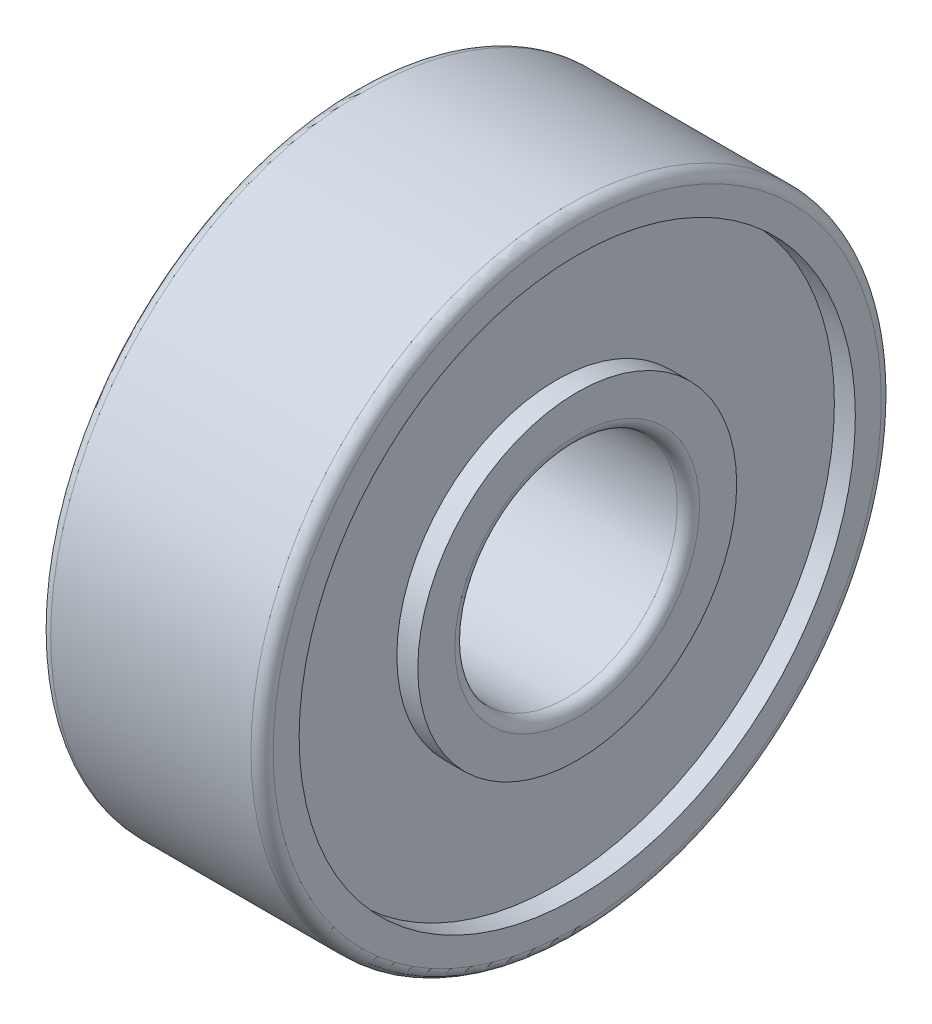
ISO-10303-21;
HEADER;
FILE_DESCRIPTION(('STEP AP214'),'2;1');
FILE_NAME('part.step','',(''),(''),'','','');
FILE_SCHEMA(('AUTOMOTIVE_DESIGN { 1 0 10303 214 1 1 1 1 }'));
ENDSEC;
DATA;
#1=APPLICATION_CONTEXT('core data for automotive mechanical design processes');
#2=APPLICATION_PROTOCOL_DEFINITION('international standard','automotive_design',2000,#1);
#3=PRODUCT_CONTEXT('',#1,'mechanical');
#4=PRODUCT('Part','Part','',(#3));
#5=PRODUCT_RELATED_PRODUCT_CATEGORY('part','',(#4));
#6=PRODUCT_DEFINITION_FORMATION('','',#4);
#7=PRODUCT_DEFINITION_CONTEXT('part definition',#1,'design');
#8=PRODUCT_DEFINITION('design','',#6,#7);
#9=PRODUCT_DEFINITION_SHAPE('','',#8);
#10=(LENGTH_UNIT() NAMED_UNIT(*) SI_UNIT(.MILLI.,.METRE.));
#11=(NAMED_UNIT(*) PLANE_ANGLE_UNIT() SI_UNIT($,.RADIAN.));
#12=(NAMED_UNIT(*) SI_UNIT($,.STERADIAN.) SOLID_ANGLE_UNIT());
#13=UNCERTAINTY_MEASURE_WITH_UNIT(LENGTH_MEASURE(1.E-05),#10,'distance_accuracy_value','');
#14=(GEOMETRIC_REPRESENTATION_CONTEXT(3) GLOBAL_UNCERTAINTY_ASSIGNED_CONTEXT((#13)) GLOBAL_UNIT_ASSIGNED_CONTEXT((#10,
#11,#12)) REPRESENTATION_CONTEXT('',''));
#15=CARTESIAN_POINT('',(0.,0.,0.));
#16=DIRECTION('',(0.,0.,1.));
#17=DIRECTION('',(1.,0.,0.));
#18=AXIS2_PLACEMENT_3D('',#15,#16,#17);
#19=CARTESIAN_POINT('',(7.5,0.,0.));
#20=DIRECTION('',(-1.,0.,0.));
#21=DIRECTION('',(0.,0.,1.));
#22=AXIS2_PLACEMENT_3D('',#19,#20,#21);
#23=CYLINDRICAL_SURFACE('',#22,3.);
#24=CARTESIAN_POINT('',(10.2,0.,0.));
#25=DIRECTION('',(1.,0.,0.));
#26=DIRECTION('',(0.,0.,1.));
#27=AXIS2_PLACEMENT_3D('',#24,#25,#26);
#28=CIRCLE('',#27,3.);
#29=CARTESIAN_POINT('',(10.2,0.,3.));
#30=VERTEX_POINT('',#29);
#31=EDGE_CURVE('E144',#30,#30,#28,.F.);
#32=ORIENTED_EDGE('',*,*,#31,.F.);
#33=EDGE_LOOP('',(#32));
#34=FACE_BOUND('',#33,.T.);
#35=CARTESIAN_POINT('',(4.8,0.,0.));
#36=DIRECTION('',(1.,0.,0.));
#37=DIRECTION('',(0.,0.,1.));
#38=AXIS2_PLACEMENT_3D('',#35,#36,#37);
#39=CIRCLE('',#38,3.);
#40=CARTESIAN_POINT('',(4.8,0.,3.));
#41=VERTEX_POINT('',#40);
#42=EDGE_CURVE('E152',#41,#41,#39,.T.);
#43=ORIENTED_EDGE('',*,*,#42,.F.);
#44=EDGE_LOOP('',(#43));
#45=FACE_BOUND('',#44,.T.);
#46=ADVANCED_FACE('F17',(#34,#45),#23,.F.);
#47=CARTESIAN_POINT('',(4.8,0.,0.));
#48=DIRECTION('',(1.,0.,0.));
#49=DIRECTION('',(0.,0.,1.));
#50=AXIS2_PLACEMENT_3D('',#47,#48,#49);
#51=TOROIDAL_SURFACE('',#50,3.3,0.300000000000001);
#52=ORIENTED_EDGE('',*,*,#42,.T.);
#53=EDGE_LOOP('',(#52));
#54=FACE_BOUND('',#53,.T.);
#55=CARTESIAN_POINT('',(4.5,0.,0.));
#56=DIRECTION('',(-1.,0.,0.));
#57=DIRECTION('',(0.,0.,-1.));
#58=AXIS2_PLACEMENT_3D('',#55,#56,#57);
#59=CIRCLE('',#58,3.3);
#60=CARTESIAN_POINT('',(4.5,-3.3,0.));
#61=VERTEX_POINT('',#60);
#62=CARTESIAN_POINT('',(4.5,0.,-3.3));
#63=VERTEX_POINT('',#62);
#64=EDGE_CURVE('E75',#61,#63,#59,.F.);
#65=ORIENTED_EDGE('',*,*,#64,.F.);
#66=CARTESIAN_POINT('',(4.5,0.,0.));
#67=DIRECTION('',(-1.,0.,0.));
#68=DIRECTION('',(0.,-1.,0.));
#69=AXIS2_PLACEMENT_3D('',#66,#67,#68);
#70=CIRCLE('',#69,3.3);
#71=CARTESIAN_POINT('',(4.5,0.,3.3));
#72=VERTEX_POINT('',#71);
#73=EDGE_CURVE('E72',#72,#61,#70,.F.);
#74=ORIENTED_EDGE('',*,*,#73,.F.);
#75=CARTESIAN_POINT('',(4.5,0.,0.));
#76=DIRECTION('',(-1.,0.,0.));
#77=DIRECTION('',(0.,0.,1.));
#78=AXIS2_PLACEMENT_3D('',#75,#76,#77);
#79=CIRCLE('',#78,3.3);
#80=EDGE_CURVE('E69',#63,#72,#79,.F.);
#81=ORIENTED_EDGE('',*,*,#80,.F.);
#82=EDGE_LOOP('',(#65,#74,#81));
#83=FACE_BOUND('',#82,.T.);
#84=ADVANCED_FACE('F74',(#54,#83),#51,.T.);
#85=CARTESIAN_POINT('',(10.2,0.,0.));
#86=DIRECTION('',(1.,0.,0.));
#87=DIRECTION('',(0.,0.,1.));
#88=AXIS2_PLACEMENT_3D('',#85,#86,#87);
#89=TOROIDAL_SURFACE('',#88,3.3,0.299999999999999);
#90=ORIENTED_EDGE('',*,*,#31,.T.);
#91=EDGE_LOOP('',(#90));
#92=FACE_BOUND('',#91,.T.);
#93=CARTESIAN_POINT('',(10.5,0.,0.));
#94=DIRECTION('',(1.,0.,0.));
#95=DIRECTION('',(0.,0.,-1.));
#96=AXIS2_PLACEMENT_3D('',#93,#94,#95);
#97=CIRCLE('',#96,3.3);
#98=CARTESIAN_POINT('',(10.5,0.,3.3));
#99=VERTEX_POINT('',#98);
#100=CARTESIAN_POINT('',(10.5,0.,-3.3));
#101=VERTEX_POINT('',#100);
#102=EDGE_CURVE('E123',#99,#101,#97,.F.);
#103=ORIENTED_EDGE('',*,*,#102,.F.);
#104=CARTESIAN_POINT('',(10.5,0.,0.));
#105=DIRECTION('',(1.,0.,0.));
#106=DIRECTION('',(0.,0.,1.));
#107=AXIS2_PLACEMENT_3D('',#104,#105,#106);
#108=CIRCLE('',#107,3.3);
#109=CARTESIAN_POINT('',(10.5,-3.3,0.));
#110=VERTEX_POINT('',#109);
#111=EDGE_CURVE('E321',#110,#99,#108,.F.);
#112=ORIENTED_EDGE('',*,*,#111,.F.);
#113=CARTESIAN_POINT('',(10.5,0.,0.));
#114=DIRECTION('',(1.,0.,0.));
#115=DIRECTION('',(0.,-1.,0.));
#116=AXIS2_PLACEMENT_3D('',#113,#114,#115);
#117=CIRCLE('',#116,3.3);
#118=EDGE_CURVE('E79',#101,#110,#117,.F.);
#119=ORIENTED_EDGE('',*,*,#118,.F.);
#120=EDGE_LOOP('',(#103,#112,#119));
#121=FACE_BOUND('',#120,.T.);
#122=ADVANCED_FACE('F104',(#92,#121),#89,.T.);
#123=CARTESIAN_POINT('',(4.5,-3.8,0.));
#124=DIRECTION('',(-1.,0.,0.));
#125=DIRECTION('',(0.,-1.,0.));
#126=AXIS2_PLACEMENT_3D('',#123,#124,#125);
#127=PLANE('',#126);
#128=ORIENTED_EDGE('',*,*,#80,.T.);
#129=ORIENTED_EDGE('',*,*,#73,.T.);
#130=ORIENTED_EDGE('',*,*,#64,.T.);
#131=EDGE_LOOP('',(#128,#129,#130));
#132=FACE_BOUND('',#131,.T.);
#133=CARTESIAN_POINT('',(4.5,0.,0.));
#134=DIRECTION('',(-1.,0.,0.));
#135=DIRECTION('',(0.,0.,1.));
#136=AXIS2_PLACEMENT_3D('',#133,#134,#135);
#137=CIRCLE('',#136,4.3);
#138=CARTESIAN_POINT('',(4.5,0.,4.3));
#139=VERTEX_POINT('',#138);
#140=EDGE_CURVE('E177',#139,#139,#137,.F.);
#141=ORIENTED_EDGE('',*,*,#140,.F.);
#142=EDGE_LOOP('',(#141));
#143=FACE_BOUND('',#142,.T.);
#144=ADVANCED_FACE('F83',(#132,#143),#127,.T.);
#145=CARTESIAN_POINT('',(10.5,-3.8,0.));
#146=DIRECTION('',(1.,0.,0.));
#147=DIRECTION('',(0.,0.,-1.));
#148=AXIS2_PLACEMENT_3D('',#145,#146,#147);
#149=PLANE('',#148);
#150=CARTESIAN_POINT('',(10.5,0.,0.));
#151=DIRECTION('',(-1.,0.,0.));
#152=DIRECTION('',(0.,0.,1.));
#153=AXIS2_PLACEMENT_3D('',#150,#151,#152);
#154=CIRCLE('',#153,4.3);
#155=CARTESIAN_POINT('',(10.5,0.,4.3));
#156=VERTEX_POINT('',#155);
#157=EDGE_CURVE('E174',#156,#156,#154,.T.);
#158=ORIENTED_EDGE('',*,*,#157,.F.);
#159=EDGE_LOOP('',(#158));
#160=FACE_BOUND('',#159,.T.);
#161=ORIENTED_EDGE('',*,*,#111,.T.);
#162=ORIENTED_EDGE('',*,*,#102,.T.);
#163=ORIENTED_EDGE('',*,*,#118,.T.);
#164=EDGE_LOOP('',(#161,#162,#163));
#165=FACE_BOUND('',#164,.T.);
#166=ADVANCED_FACE('F103',(#160,#165),#149,.T.);
#167=CARTESIAN_POINT('',(4.7825,0.,0.));
#168=DIRECTION('',(-1.,0.,0.));
#169=DIRECTION('',(0.,0.,1.));
#170=AXIS2_PLACEMENT_3D('',#167,#168,#169);
#171=CYLINDRICAL_SURFACE('',#170,4.3);
#172=CARTESIAN_POINT('',(5.065,0.,0.));
#173=DIRECTION('',(-1.,0.,0.));
#174=DIRECTION('',(0.,0.,1.));
#175=AXIS2_PLACEMENT_3D('',#172,#173,#174);
#176=CIRCLE('',#175,4.3);
#177=CARTESIAN_POINT('',(5.065,0.,4.3));
#178=VERTEX_POINT('',#177);
#179=EDGE_CURVE('E171',#178,#178,#176,.F.);
#180=ORIENTED_EDGE('',*,*,#179,.F.);
#181=EDGE_LOOP('',(#180));
#182=FACE_BOUND('',#181,.T.);
#183=ORIENTED_EDGE('',*,*,#140,.T.);
#184=EDGE_LOOP('',(#183));
#185=FACE_BOUND('',#184,.T.);
#186=ADVANCED_FACE('F339',(#182,#185),#171,.T.);
#187=CARTESIAN_POINT('',(10.2175,0.,0.));
#188=DIRECTION('',(-1.,0.,0.));
#189=DIRECTION('',(0.,0.,1.));
#190=AXIS2_PLACEMENT_3D('',#187,#188,#189);
#191=CYLINDRICAL_SURFACE('',#190,4.3);
#192=ORIENTED_EDGE('',*,*,#157,.T.);
#193=EDGE_LOOP('',(#192));
#194=FACE_BOUND('',#193,.T.);
#195=CARTESIAN_POINT('',(9.935,0.,0.));
#196=DIRECTION('',(-1.,0.,0.));
#197=DIRECTION('',(0.,0.,1.));
#198=AXIS2_PLACEMENT_3D('',#195,#196,#197);
#199=CIRCLE('',#198,4.3);
#200=CARTESIAN_POINT('',(9.935,0.,4.3));
#201=VERTEX_POINT('',#200);
#202=EDGE_CURVE('E168',#201,#201,#199,.T.);
#203=ORIENTED_EDGE('',*,*,#202,.F.);
#204=EDGE_LOOP('',(#203));
#205=FACE_BOUND('',#204,.T.);
#206=ADVANCED_FACE('F345',(#194,#205),#191,.T.);
#207=CARTESIAN_POINT('',(5.065,-5.9,0.));
#208=DIRECTION('',(-1.,0.,0.));
#209=DIRECTION('',(0.,0.,1.));
#210=AXIS2_PLACEMENT_3D('',#207,#208,#209);
#211=PLANE('',#210);
#212=ORIENTED_EDGE('',*,*,#179,.T.);
#213=EDGE_LOOP('',(#212));
#214=FACE_BOUND('',#213,.T.);
#215=CARTESIAN_POINT('',(5.065,0.,0.));
#216=DIRECTION('',(-1.,0.,0.));
#217=DIRECTION('',(0.,0.,1.));
#218=AXIS2_PLACEMENT_3D('',#215,#216,#217);
#219=CIRCLE('',#218,7.5);
#220=CARTESIAN_POINT('',(5.065,0.,7.5));
#221=VERTEX_POINT('',#220);
#222=EDGE_CURVE('E165',#221,#221,#219,.T.);
#223=ORIENTED_EDGE('',*,*,#222,.T.);
#224=EDGE_LOOP('',(#223));
#225=FACE_BOUND('',#224,.T.);
#226=ADVANCED_FACE('F429',(#214,#225),#211,.T.);
#227=CARTESIAN_POINT('',(9.935,-5.9,0.));
#228=DIRECTION('',(1.,0.,0.));
#229=DIRECTION('',(0.,0.,-1.));
#230=AXIS2_PLACEMENT_3D('',#227,#228,#229);
#231=PLANE('',#230);
#232=CARTESIAN_POINT('',(9.935,0.,0.));
#233=DIRECTION('',(-1.,0.,0.));
#234=DIRECTION('',(0.,0.,1.));
#235=AXIS2_PLACEMENT_3D('',#232,#233,#234);
#236=CIRCLE('',#235,7.5);
#237=CARTESIAN_POINT('',(9.935,0.,7.5));
#238=VERTEX_POINT('',#237);
#239=EDGE_CURVE('E162',#238,#238,#236,.F.);
#240=ORIENTED_EDGE('',*,*,#239,.T.);
#241=EDGE_LOOP('',(#240));
#242=FACE_BOUND('',#241,.T.);
#243=ORIENTED_EDGE('',*,*,#202,.T.);
#244=EDGE_LOOP('',(#243));
#245=FACE_BOUND('',#244,.T.);
#246=ADVANCED_FACE('F419',(#242,#245),#231,.T.);
#247=CARTESIAN_POINT('',(4.7825,0.,0.));
#248=DIRECTION('',(-1.,0.,0.));
#249=DIRECTION('',(0.,0.,1.));
#250=AXIS2_PLACEMENT_3D('',#247,#248,#249);
#251=CYLINDRICAL_SURFACE('',#250,7.5);
#252=CARTESIAN_POINT('',(4.5,0.,0.));
#253=DIRECTION('',(-1.,0.,0.));
#254=DIRECTION('',(0.,0.,1.));
#255=AXIS2_PLACEMENT_3D('',#252,#253,#254);
#256=CIRCLE('',#255,7.5);
#257=CARTESIAN_POINT('',(4.5,0.,7.5));
#258=VERTEX_POINT('',#257);
#259=EDGE_CURVE('E159',#258,#258,#256,.F.);
#260=ORIENTED_EDGE('',*,*,#259,.F.);
#261=EDGE_LOOP('',(#260));
#262=FACE_BOUND('',#261,.T.);
#263=ORIENTED_EDGE('',*,*,#222,.F.);
#264=EDGE_LOOP('',(#263));
#265=FACE_BOUND('',#264,.T.);
#266=ADVANCED_FACE('F410',(#262,#265),#251,.F.);
#267=CARTESIAN_POINT('',(10.2175,0.,0.));
#268=DIRECTION('',(-1.,0.,0.));
#269=DIRECTION('',(0.,0.,1.));
#270=AXIS2_PLACEMENT_3D('',#267,#268,#269);
#271=CYLINDRICAL_SURFACE('',#270,7.5);
#272=ORIENTED_EDGE('',*,*,#239,.F.);
#273=EDGE_LOOP('',(#272));
#274=FACE_BOUND('',#273,.T.);
#275=CARTESIAN_POINT('',(10.5,0.,0.));
#276=DIRECTION('',(-1.,0.,0.));
#277=DIRECTION('',(0.,0.,1.));
#278=AXIS2_PLACEMENT_3D('',#275,#276,#277);
#279=CIRCLE('',#278,7.5);
#280=CARTESIAN_POINT('',(10.5,0.,7.5));
#281=VERTEX_POINT('',#280);
#282=EDGE_CURVE('E155',#281,#281,#279,.T.);
#283=ORIENTED_EDGE('',*,*,#282,.F.);
#284=EDGE_LOOP('',(#283));
#285=FACE_BOUND('',#284,.T.);
#286=ADVANCED_FACE('F401',(#274,#285),#271,.F.);
#287=CARTESIAN_POINT('',(4.5,-7.85,0.));
#288=DIRECTION('',(-1.,0.,0.));
#289=DIRECTION('',(0.,0.,1.));
#290=AXIS2_PLACEMENT_3D('',#287,#288,#289);
#291=PLANE('',#290);
#292=ORIENTED_EDGE('',*,*,#259,.T.);
#293=EDGE_LOOP('',(#292));
#294=FACE_BOUND('',#293,.T.);
#295=CARTESIAN_POINT('',(4.5,0.,0.));
#296=DIRECTION('',(1.,0.,0.));
#297=DIRECTION('',(0.,0.,1.));
#298=AXIS2_PLACEMENT_3D('',#295,#296,#297);
#299=CIRCLE('',#298,8.2);
#300=CARTESIAN_POINT('',(4.5,0.,8.2));
#301=VERTEX_POINT('',#300);
#302=CARTESIAN_POINT('',(4.5,-8.2,0.));
#303=VERTEX_POINT('',#302);
#304=EDGE_CURVE('E158',#301,#303,#299,.T.);
#305=ORIENTED_EDGE('',*,*,#304,.F.);
#306=CARTESIAN_POINT('',(4.5,0.,0.));
#307=DIRECTION('',(1.,0.,0.));
#308=DIRECTION('',(0.,0.,-1.));
#309=AXIS2_PLACEMENT_3D('',#306,#307,#308);
#310=CIRCLE('',#309,8.2);
#311=CARTESIAN_POINT('',(4.5,0.,-8.2));
#312=VERTEX_POINT('',#311);
#313=EDGE_CURVE('E288',#312,#301,#310,.T.);
#314=ORIENTED_EDGE('',*,*,#313,.F.);
#315=CARTESIAN_POINT('',(4.5,0.,0.));
#316=DIRECTION('',(1.,0.,0.));
#317=DIRECTION('',(0.,-1.,0.));
#318=AXIS2_PLACEMENT_3D('',#315,#316,#317);
#319=CIRCLE('',#318,8.2);
#320=EDGE_CURVE('E268',#303,#312,#319,.T.);
#321=ORIENTED_EDGE('',*,*,#320,.F.);
#322=EDGE_LOOP('',(#305,#314,#321));
#323=FACE_BOUND('',#322,.T.);
#324=ADVANCED_FACE('F227',(#294,#323),#291,.T.);
#325=CARTESIAN_POINT('',(10.5,-7.85,0.));
#326=DIRECTION('',(1.,0.,0.));
#327=DIRECTION('',(0.,0.,-1.));
#328=AXIS2_PLACEMENT_3D('',#325,#326,#327);
#329=PLANE('',#328);
#330=CARTESIAN_POINT('',(10.5,0.,0.));
#331=DIRECTION('',(-1.,0.,0.));
#332=DIRECTION('',(0.,0.,1.));
#333=AXIS2_PLACEMENT_3D('',#330,#331,#332);
#334=CIRCLE('',#333,8.2);
#335=CARTESIAN_POINT('',(10.5,0.,8.2));
#336=VERTEX_POINT('',#335);
#337=CARTESIAN_POINT('',(10.5,0.,-8.2));
#338=VERTEX_POINT('',#337);
#339=EDGE_CURVE('E182',#336,#338,#334,.T.);
#340=ORIENTED_EDGE('',*,*,#339,.F.);
#341=CARTESIAN_POINT('',(10.5,0.,0.));
#342=DIRECTION('',(-1.,0.,0.));
#343=DIRECTION('',(0.,-1.,0.));
#344=AXIS2_PLACEMENT_3D('',#341,#342,#343);
#345=CIRCLE('',#344,8.2);
#346=CARTESIAN_POINT('',(10.5,-8.2,0.));
#347=VERTEX_POINT('',#346);
#348=EDGE_CURVE('E36',#347,#336,#345,.T.);
#349=ORIENTED_EDGE('',*,*,#348,.F.);
#350=CARTESIAN_POINT('',(10.5,0.,0.));
#351=DIRECTION('',(-1.,0.,0.));
#352=DIRECTION('',(0.,0.,-1.));
#353=AXIS2_PLACEMENT_3D('',#350,#351,#352);
#354=CIRCLE('',#353,8.2);
#355=EDGE_CURVE('E213',#338,#347,#354,.T.);
#356=ORIENTED_EDGE('',*,*,#355,.F.);
#357=EDGE_LOOP('',(#340,#349,#356));
#358=FACE_BOUND('',#357,.T.);
#359=ORIENTED_EDGE('',*,*,#282,.T.);
#360=EDGE_LOOP('',(#359));
#361=FACE_BOUND('',#360,.T.);
#362=ADVANCED_FACE('F218',(#358,#361),#329,.T.);
#363=CARTESIAN_POINT('',(4.8,0.,0.));
#364=DIRECTION('',(1.,0.,0.));
#365=DIRECTION('',(0.,0.,1.));
#366=AXIS2_PLACEMENT_3D('',#363,#364,#365);
#367=TOROIDAL_SURFACE('',#366,8.2,0.300000000000001);
#368=CARTESIAN_POINT('',(4.8,0.,0.));
#369=DIRECTION('',(-1.,0.,0.));
#370=DIRECTION('',(0.,0.,1.));
#371=AXIS2_PLACEMENT_3D('',#368,#369,#370);
#372=CIRCLE('',#371,8.5);
#373=CARTESIAN_POINT('',(4.8,0.,8.5));
#374=VERTEX_POINT('',#373);
#375=EDGE_CURVE('E27',#374,#374,#372,.F.);
#376=ORIENTED_EDGE('',*,*,#375,.F.);
#377=EDGE_LOOP('',(#376));
#378=FACE_BOUND('',#377,.T.);
#379=ORIENTED_EDGE('',*,*,#313,.T.);
#380=ORIENTED_EDGE('',*,*,#304,.T.);
#381=ORIENTED_EDGE('',*,*,#320,.T.);
#382=EDGE_LOOP('',(#379,#380,#381));
#383=FACE_BOUND('',#382,.T.);
#384=ADVANCED_FACE('F201',(#378,#383),#367,.T.);
#385=CARTESIAN_POINT('',(10.2,0.,0.));
#386=DIRECTION('',(1.,0.,0.));
#387=DIRECTION('',(0.,0.,1.));
#388=AXIS2_PLACEMENT_3D('',#385,#386,#387);
#389=TOROIDAL_SURFACE('',#388,8.2,0.300000000000002);
#390=CARTESIAN_POINT('',(10.2,0.,0.));
#391=DIRECTION('',(-1.,0.,0.));
#392=DIRECTION('',(0.,0.,1.));
#393=AXIS2_PLACEMENT_3D('',#390,#391,#392);
#394=CIRCLE('',#393,8.5);
#395=CARTESIAN_POINT('',(10.2,0.,8.5));
#396=VERTEX_POINT('',#395);
#397=EDGE_CURVE('E11',#396,#396,#394,.T.);
#398=ORIENTED_EDGE('',*,*,#397,.F.);
#399=EDGE_LOOP('',(#398));
#400=FACE_BOUND('',#399,.T.);
#401=ORIENTED_EDGE('',*,*,#355,.T.);
#402=ORIENTED_EDGE('',*,*,#348,.T.);
#403=ORIENTED_EDGE('',*,*,#339,.T.);
#404=EDGE_LOOP('',(#401,#402,#403));
#405=FACE_BOUND('',#404,.T.);
#406=ADVANCED_FACE('F189',(#400,#405),#389,.T.);
#407=CARTESIAN_POINT('',(7.5,0.,0.));
#408=DIRECTION('',(-1.,0.,0.));
#409=DIRECTION('',(0.,0.,1.));
#410=AXIS2_PLACEMENT_3D('',#407,#408,#409);
#411=CYLINDRICAL_SURFACE('',#410,8.5);
#412=ORIENTED_EDGE('',*,*,#375,.T.);
#413=EDGE_LOOP('',(#412));
#414=FACE_BOUND('',#413,.T.);
#415=ORIENTED_EDGE('',*,*,#397,.T.);
#416=EDGE_LOOP('',(#415));
#417=FACE_BOUND('',#416,.T.);
#418=ADVANCED_FACE('F200',(#414,#417),#411,.T.);
#419=CLOSED_SHELL('',(#46,#84,#122,#144,#166,#186,#206,#226,#246,#266,#286,#324,#362,#384,#406,#418));
#420=MANIFOLD_SOLID_BREP('B1',#419);
#421=ADVANCED_BREP_SHAPE_REPRESENTATION('',(#18,#420),#14);
#422=SHAPE_DEFINITION_REPRESENTATION(#9,#421);
ENDSEC;
END-ISO-10303-21;
